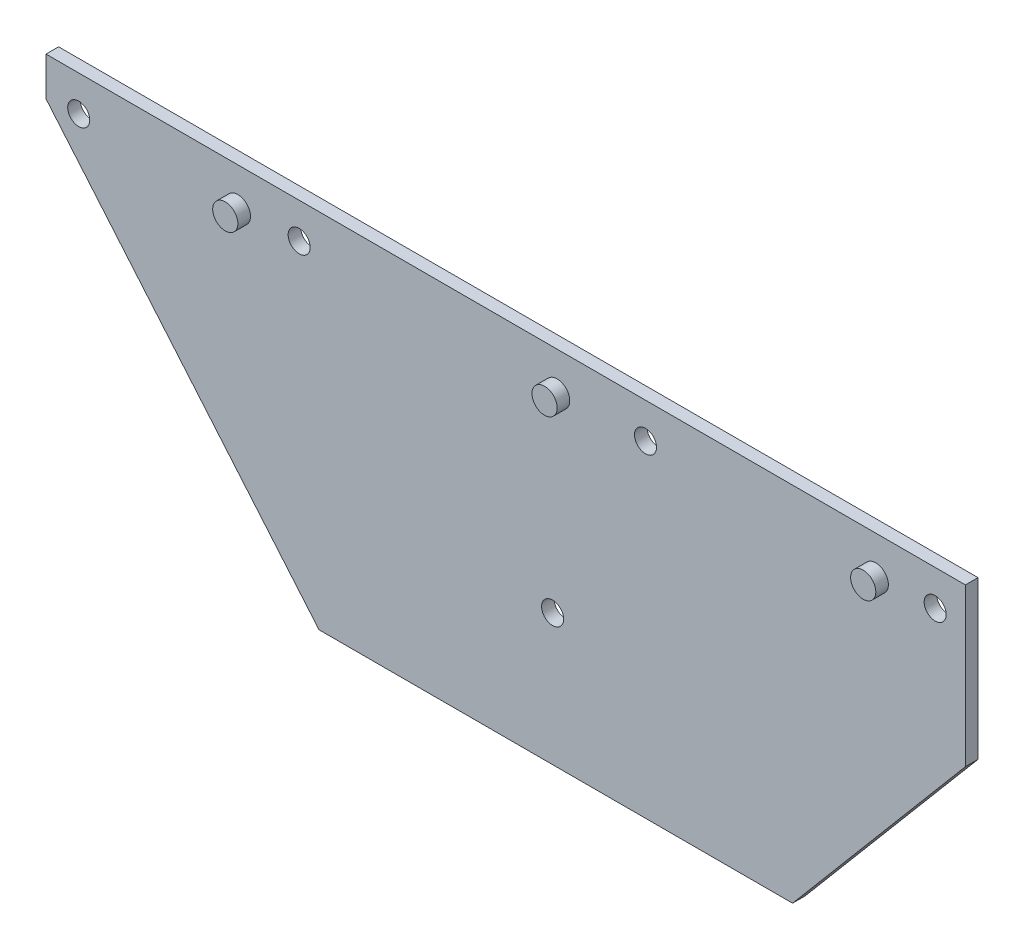
ISO-10303-21;
HEADER;
FILE_DESCRIPTION(('STEP AP214'),'2;1');
FILE_NAME('part.step','',(''),(''),'','','');
FILE_SCHEMA(('AUTOMOTIVE_DESIGN { 1 0 10303 214 1 1 1 1 }'));
ENDSEC;
DATA;
#1=APPLICATION_CONTEXT('core data for automotive mechanical design processes');
#2=APPLICATION_PROTOCOL_DEFINITION('international standard','automotive_design',2000,#1);
#3=PRODUCT_CONTEXT('',#1,'mechanical');
#4=PRODUCT('Part','Part','',(#3));
#5=PRODUCT_RELATED_PRODUCT_CATEGORY('part','',(#4));
#6=PRODUCT_DEFINITION_FORMATION('','',#4);
#7=PRODUCT_DEFINITION_CONTEXT('part definition',#1,'design');
#8=PRODUCT_DEFINITION('design','',#6,#7);
#9=PRODUCT_DEFINITION_SHAPE('','',#8);
#10=(LENGTH_UNIT() NAMED_UNIT(*) SI_UNIT(.MILLI.,.METRE.));
#11=(NAMED_UNIT(*) PLANE_ANGLE_UNIT() SI_UNIT($,.RADIAN.));
#12=(NAMED_UNIT(*) SI_UNIT($,.STERADIAN.) SOLID_ANGLE_UNIT());
#13=UNCERTAINTY_MEASURE_WITH_UNIT(LENGTH_MEASURE(1.E-05),#10,'distance_accuracy_value','');
#14=(GEOMETRIC_REPRESENTATION_CONTEXT(3) GLOBAL_UNCERTAINTY_ASSIGNED_CONTEXT((#13)) GLOBAL_UNIT_ASSIGNED_CONTEXT((#10,
#11,#12)) REPRESENTATION_CONTEXT('',''));
#15=CARTESIAN_POINT('',(0.,0.,0.));
#16=DIRECTION('',(0.,0.,1.));
#17=DIRECTION('',(1.,0.,0.));
#18=AXIS2_PLACEMENT_3D('',#15,#16,#17);
#19=CARTESIAN_POINT('',(0.,0.,2.));
#20=DIRECTION('',(0.,0.,-1.));
#21=DIRECTION('',(-1.,0.,0.));
#22=AXIS2_PLACEMENT_3D('',#19,#20,#21);
#23=PLANE('',#22);
#24=CARTESIAN_POINT('',(58.7699999999999,22.6620282392228,2.));
#25=DIRECTION('',(0.,0.,-1.));
#26=DIRECTION('',(-1.,0.,0.));
#27=AXIS2_PLACEMENT_3D('',#24,#25,#26);
#28=CIRCLE('',#27,2.);
#29=CARTESIAN_POINT('',(56.7699999999999,22.6620282392228,2.));
#30=VERTEX_POINT('',#29);
#31=EDGE_CURVE('E44',#30,#30,#28,.F.);
#32=ORIENTED_EDGE('',*,*,#31,.F.);
#33=EDGE_LOOP('',(#32));
#34=FACE_BOUND('',#33,.T.);
#35=DIRECTION('',(0.,1.,0.));
#36=VECTOR('',#35,1.);
#37=CARTESIAN_POINT('',(72.9999999999999,3.75,2.));
#38=LINE('',#37,#36);
#39=CARTESIAN_POINT('',(72.9999999999999,3.75,2.));
#40=VERTEX_POINT('',#39);
#41=CARTESIAN_POINT('',(72.9999999999999,28.75,2.));
#42=VERTEX_POINT('',#41);
#43=EDGE_CURVE('E132',#40,#42,#38,.T.);
#44=ORIENTED_EDGE('',*,*,#43,.T.);
#45=DIRECTION('',(-1.,0.,0.));
#46=VECTOR('',#45,1.);
#47=CARTESIAN_POINT('',(-73.0000000000001,28.75,2.));
#48=LINE('',#47,#46);
#49=CARTESIAN_POINT('',(-73.0000000000001,28.75,2.));
#50=VERTEX_POINT('',#49);
#51=EDGE_CURVE('E90',#42,#50,#48,.T.);
#52=ORIENTED_EDGE('',*,*,#51,.T.);
#53=DIRECTION('',(0.,-1.,0.));
#54=VECTOR('',#53,1.);
#55=CARTESIAN_POINT('',(-73.,22.5898311404297,2.));
#56=LINE('',#55,#54);
#57=CARTESIAN_POINT('',(-73.,22.5898311404297,2.));
#58=VERTEX_POINT('',#57);
#59=EDGE_CURVE('E103',#50,#58,#56,.T.);
#60=ORIENTED_EDGE('',*,*,#59,.T.);
#61=DIRECTION('',(0.645191033295566,-0.764021289333615,0.));
#62=VECTOR('',#61,1.);
#63=CARTESIAN_POINT('',(-73.,22.5898311404297,2.));
#64=LINE('',#63,#62);
#65=CARTESIAN_POINT('',(-29.645188864299,-28.75,2.));
#66=VERTEX_POINT('',#65);
#67=EDGE_CURVE('E97',#58,#66,#64,.T.);
#68=ORIENTED_EDGE('',*,*,#67,.T.);
#69=DIRECTION('',(1.,0.,0.));
#70=VECTOR('',#69,1.);
#71=CARTESIAN_POINT('',(-29.645188864299,-28.75,2.));
#72=LINE('',#71,#70);
#73=CARTESIAN_POINT('',(45.5548111357011,-28.75,2.));
#74=VERTEX_POINT('',#73);
#75=EDGE_CURVE('E101',#66,#74,#72,.T.);
#76=ORIENTED_EDGE('',*,*,#75,.T.);
#77=DIRECTION('',(0.645191033295572,0.76402128933361,0.));
#78=VECTOR('',#77,1.);
#79=CARTESIAN_POINT('',(72.9999999999999,3.75,2.));
#80=LINE('',#79,#78);
#81=EDGE_CURVE('E52',#74,#40,#80,.T.);
#82=ORIENTED_EDGE('',*,*,#81,.T.);
#83=EDGE_LOOP('',(#44,#52,#60,#68,#76,#82));
#84=FACE_BOUND('',#83,.T.);
#85=CARTESIAN_POINT('',(22.1999999999999,23.13,2.));
#86=DIRECTION('',(0.,0.,1.));
#87=DIRECTION('',(1.,0.,0.));
#88=AXIS2_PLACEMENT_3D('',#85,#86,#87);
#89=CIRCLE('',#88,1.75);
#90=CARTESIAN_POINT('',(23.9499999999999,23.13,2.));
#91=VERTEX_POINT('',#90);
#92=EDGE_CURVE('E125',#91,#91,#89,.T.);
#93=ORIENTED_EDGE('',*,*,#92,.F.);
#94=EDGE_LOOP('',(#93));
#95=FACE_BOUND('',#94,.T.);
#96=CARTESIAN_POINT('',(68.1999999999999,23.13,2.));
#97=DIRECTION('',(0.,0.,1.));
#98=DIRECTION('',(1.,0.,0.));
#99=AXIS2_PLACEMENT_3D('',#96,#97,#98);
#100=CIRCLE('',#99,1.75);
#101=CARTESIAN_POINT('',(69.9499999999999,23.13,2.));
#102=VERTEX_POINT('',#101);
#103=EDGE_CURVE('E187',#102,#102,#100,.T.);
#104=ORIENTED_EDGE('',*,*,#103,.F.);
#105=EDGE_LOOP('',(#104));
#106=FACE_BOUND('',#105,.T.);
#107=CARTESIAN_POINT('',(-32.8000000000001,23.13,2.));
#108=DIRECTION('',(0.,0.,1.));
#109=DIRECTION('',(1.,0.,0.));
#110=AXIS2_PLACEMENT_3D('',#107,#108,#109);
#111=CIRCLE('',#110,1.75);
#112=CARTESIAN_POINT('',(-31.0500000000001,23.13,2.));
#113=VERTEX_POINT('',#112);
#114=EDGE_CURVE('E193',#113,#113,#111,.T.);
#115=ORIENTED_EDGE('',*,*,#114,.F.);
#116=EDGE_LOOP('',(#115));
#117=FACE_BOUND('',#116,.T.);
#118=CARTESIAN_POINT('',(-67.8000000000001,23.13,2.));
#119=DIRECTION('',(0.,0.,1.));
#120=DIRECTION('',(1.,0.,0.));
#121=AXIS2_PLACEMENT_3D('',#118,#119,#120);
#122=CIRCLE('',#121,1.75);
#123=CARTESIAN_POINT('',(-66.0500000000001,23.13,2.));
#124=VERTEX_POINT('',#123);
#125=EDGE_CURVE('E199',#124,#124,#122,.T.);
#126=ORIENTED_EDGE('',*,*,#125,.F.);
#127=EDGE_LOOP('',(#126));
#128=FACE_BOUND('',#127,.T.);
#129=CARTESIAN_POINT('',(7.44999999999993,-7.86999999999999,2.));
#130=DIRECTION('',(0.,0.,1.));
#131=DIRECTION('',(1.,0.,0.));
#132=AXIS2_PLACEMENT_3D('',#129,#130,#131);
#133=CIRCLE('',#132,1.75);
#134=CARTESIAN_POINT('',(9.19999999999994,-7.86999999999999,2.));
#135=VERTEX_POINT('',#134);
#136=EDGE_CURVE('E205',#135,#135,#133,.T.);
#137=ORIENTED_EDGE('',*,*,#136,.F.);
#138=EDGE_LOOP('',(#137));
#139=FACE_BOUND('',#138,.T.);
#140=CARTESIAN_POINT('',(8.16999999999995,22.6620282392228,2.));
#141=DIRECTION('',(0.,0.,-1.));
#142=DIRECTION('',(-1.,0.,0.));
#143=AXIS2_PLACEMENT_3D('',#140,#141,#142);
#144=CIRCLE('',#143,2.);
#145=CARTESIAN_POINT('',(6.16999999999995,22.6620282392228,2.));
#146=VERTEX_POINT('',#145);
#147=EDGE_CURVE('E141',#146,#146,#144,.F.);
#148=ORIENTED_EDGE('',*,*,#147,.F.);
#149=EDGE_LOOP('',(#148));
#150=FACE_BOUND('',#149,.T.);
#151=CARTESIAN_POINT('',(-42.5300000000001,22.6620282392228,2.));
#152=DIRECTION('',(0.,0.,-1.));
#153=DIRECTION('',(-1.,0.,0.));
#154=AXIS2_PLACEMENT_3D('',#151,#152,#153);
#155=CIRCLE('',#154,2.);
#156=CARTESIAN_POINT('',(-44.5300000000001,22.6620282392228,2.));
#157=VERTEX_POINT('',#156);
#158=EDGE_CURVE('E11',#157,#157,#155,.F.);
#159=ORIENTED_EDGE('',*,*,#158,.F.);
#160=EDGE_LOOP('',(#159));
#161=FACE_BOUND('',#160,.T.);
#162=ADVANCED_FACE('F35',(#34,#84,#95,#106,#117,#128,#139,#150,#161),#23,.F.);
#163=CARTESIAN_POINT('',(72.9999999999999,3.75,2.));
#164=DIRECTION('',(-1.,0.,0.));
#165=DIRECTION('',(0.,0.,1.));
#166=AXIS2_PLACEMENT_3D('',#163,#164,#165);
#167=PLANE('',#166);
#168=DIRECTION('',(0.,1.,0.));
#169=VECTOR('',#168,1.);
#170=CARTESIAN_POINT('',(72.9999999999999,3.75,0.));
#171=LINE('',#170,#169);
#172=CARTESIAN_POINT('',(72.9999999999999,3.75,0.));
#173=VERTEX_POINT('',#172);
#174=CARTESIAN_POINT('',(72.9999999999999,28.75,0.));
#175=VERTEX_POINT('',#174);
#176=EDGE_CURVE('E121',#173,#175,#171,.T.);
#177=ORIENTED_EDGE('',*,*,#176,.T.);
#178=DIRECTION('',(0.,0.,-1.));
#179=VECTOR('',#178,1.);
#180=CARTESIAN_POINT('',(72.9999999999999,28.75,2.));
#181=LINE('',#180,#179);
#182=EDGE_CURVE('E139',#42,#175,#181,.T.);
#183=ORIENTED_EDGE('',*,*,#182,.F.);
#184=ORIENTED_EDGE('',*,*,#43,.F.);
#185=DIRECTION('',(0.,0.,-1.));
#186=VECTOR('',#185,1.);
#187=CARTESIAN_POINT('',(72.9999999999999,3.75,2.));
#188=LINE('',#187,#186);
#189=EDGE_CURVE('E117',#40,#173,#188,.T.);
#190=ORIENTED_EDGE('',*,*,#189,.T.);
#191=EDGE_LOOP('',(#177,#183,#184,#190));
#192=FACE_BOUND('',#191,.T.);
#193=ADVANCED_FACE('F37',(#192),#167,.F.);
#194=CARTESIAN_POINT('',(-73.0000000000001,28.75,2.));
#195=DIRECTION('',(0.,-1.,0.));
#196=DIRECTION('',(0.,0.,-1.));
#197=AXIS2_PLACEMENT_3D('',#194,#195,#196);
#198=PLANE('',#197);
#199=DIRECTION('',(-1.,0.,0.));
#200=VECTOR('',#199,1.);
#201=CARTESIAN_POINT('',(-73.0000000000001,28.75,0.));
#202=LINE('',#201,#200);
#203=CARTESIAN_POINT('',(-73.0000000000001,28.75,0.));
#204=VERTEX_POINT('',#203);
#205=EDGE_CURVE('E124',#175,#204,#202,.T.);
#206=ORIENTED_EDGE('',*,*,#205,.T.);
#207=DIRECTION('',(0.,0.,-1.));
#208=VECTOR('',#207,1.);
#209=CARTESIAN_POINT('',(-73.0000000000001,28.75,2.));
#210=LINE('',#209,#208);
#211=EDGE_CURVE('E136',#50,#204,#210,.T.);
#212=ORIENTED_EDGE('',*,*,#211,.F.);
#213=ORIENTED_EDGE('',*,*,#51,.F.);
#214=ORIENTED_EDGE('',*,*,#182,.T.);
#215=EDGE_LOOP('',(#206,#212,#213,#214));
#216=FACE_BOUND('',#215,.T.);
#217=ADVANCED_FACE('F153',(#216),#198,.F.);
#218=CARTESIAN_POINT('',(-73.,22.5898311404297,2.));
#219=DIRECTION('',(1.,0.,0.));
#220=DIRECTION('',(0.,1.,0.));
#221=AXIS2_PLACEMENT_3D('',#218,#219,#220);
#222=PLANE('',#221);
#223=DIRECTION('',(0.,-1.,0.));
#224=VECTOR('',#223,1.);
#225=CARTESIAN_POINT('',(-73.,22.5898311404297,0.));
#226=LINE('',#225,#224);
#227=CARTESIAN_POINT('',(-73.,22.5898311404297,0.));
#228=VERTEX_POINT('',#227);
#229=EDGE_CURVE('E127',#204,#228,#226,.T.);
#230=ORIENTED_EDGE('',*,*,#229,.T.);
#231=DIRECTION('',(0.,0.,-1.));
#232=VECTOR('',#231,1.);
#233=CARTESIAN_POINT('',(-73.,22.5898311404297,2.));
#234=LINE('',#233,#232);
#235=EDGE_CURVE('E112',#58,#228,#234,.T.);
#236=ORIENTED_EDGE('',*,*,#235,.F.);
#237=ORIENTED_EDGE('',*,*,#59,.F.);
#238=ORIENTED_EDGE('',*,*,#211,.T.);
#239=EDGE_LOOP('',(#230,#236,#237,#238));
#240=FACE_BOUND('',#239,.T.);
#241=ADVANCED_FACE('F170',(#240),#222,.F.);
#242=CARTESIAN_POINT('',(-73.,22.5898311404297,2.));
#243=DIRECTION('',(0.764021289333615,0.645191033295566,0.));
#244=DIRECTION('',(-0.645191033295566,0.764021289333615,0.));
#245=AXIS2_PLACEMENT_3D('',#242,#243,#244);
#246=PLANE('',#245);
#247=DIRECTION('',(0.645191033295566,-0.764021289333615,0.));
#248=VECTOR('',#247,1.);
#249=CARTESIAN_POINT('',(-73.,22.5898311404297,0.));
#250=LINE('',#249,#248);
#251=CARTESIAN_POINT('',(-29.645188864299,-28.75,0.));
#252=VERTEX_POINT('',#251);
#253=EDGE_CURVE('E111',#228,#252,#250,.T.);
#254=ORIENTED_EDGE('',*,*,#253,.T.);
#255=DIRECTION('',(0.,0.,-1.));
#256=VECTOR('',#255,1.);
#257=CARTESIAN_POINT('',(-29.645188864299,-28.75,2.));
#258=LINE('',#257,#256);
#259=EDGE_CURVE('E108',#66,#252,#258,.T.);
#260=ORIENTED_EDGE('',*,*,#259,.F.);
#261=ORIENTED_EDGE('',*,*,#67,.F.);
#262=ORIENTED_EDGE('',*,*,#235,.T.);
#263=EDGE_LOOP('',(#254,#260,#261,#262));
#264=FACE_BOUND('',#263,.T.);
#265=ADVANCED_FACE('F109',(#264),#246,.F.);
#266=CARTESIAN_POINT('',(-29.645188864299,-28.75,2.));
#267=DIRECTION('',(0.,1.,0.));
#268=DIRECTION('',(-1.,0.,0.));
#269=AXIS2_PLACEMENT_3D('',#266,#267,#268);
#270=PLANE('',#269);
#271=DIRECTION('',(1.,0.,0.));
#272=VECTOR('',#271,1.);
#273=CARTESIAN_POINT('',(-29.645188864299,-28.75,0.));
#274=LINE('',#273,#272);
#275=CARTESIAN_POINT('',(45.5548111357011,-28.75,0.));
#276=VERTEX_POINT('',#275);
#277=EDGE_CURVE('E75',#252,#276,#274,.T.);
#278=ORIENTED_EDGE('',*,*,#277,.T.);
#279=DIRECTION('',(0.,0.,-1.));
#280=VECTOR('',#279,1.);
#281=CARTESIAN_POINT('',(45.5548111357011,-28.75,2.));
#282=LINE('',#281,#280);
#283=EDGE_CURVE('E113',#74,#276,#282,.T.);
#284=ORIENTED_EDGE('',*,*,#283,.F.);
#285=ORIENTED_EDGE('',*,*,#75,.F.);
#286=ORIENTED_EDGE('',*,*,#259,.T.);
#287=EDGE_LOOP('',(#278,#284,#285,#286));
#288=FACE_BOUND('',#287,.T.);
#289=ADVANCED_FACE('F115',(#288),#270,.F.);
#290=CARTESIAN_POINT('',(72.9999999999999,3.75,2.));
#291=DIRECTION('',(-0.76402128933361,0.645191033295572,0.));
#292=DIRECTION('',(-0.645191033295572,-0.764021289333611,0.));
#293=AXIS2_PLACEMENT_3D('',#290,#291,#292);
#294=PLANE('',#293);
#295=DIRECTION('',(0.645191033295572,0.76402128933361,0.));
#296=VECTOR('',#295,1.);
#297=CARTESIAN_POINT('',(72.9999999999999,3.75,0.));
#298=LINE('',#297,#296);
#299=EDGE_CURVE('E81',#276,#173,#298,.T.);
#300=ORIENTED_EDGE('',*,*,#299,.T.);
#301=ORIENTED_EDGE('',*,*,#189,.F.);
#302=ORIENTED_EDGE('',*,*,#81,.F.);
#303=ORIENTED_EDGE('',*,*,#283,.T.);
#304=EDGE_LOOP('',(#300,#301,#302,#303));
#305=FACE_BOUND('',#304,.T.);
#306=ADVANCED_FACE('F162',(#305),#294,.F.);
#307=CARTESIAN_POINT('',(0.,0.,0.));
#308=DIRECTION('',(0.,0.,-1.));
#309=DIRECTION('',(-1.,0.,0.));
#310=AXIS2_PLACEMENT_3D('',#307,#308,#309);
#311=PLANE('',#310);
#312=CARTESIAN_POINT('',(7.44999999999993,-7.86999999999999,0.));
#313=DIRECTION('',(0.,0.,-1.));
#314=DIRECTION('',(-1.,0.,0.));
#315=AXIS2_PLACEMENT_3D('',#312,#313,#314);
#316=CIRCLE('',#315,1.75);
#317=CARTESIAN_POINT('',(5.69999999999993,-7.86999999999999,0.));
#318=VERTEX_POINT('',#317);
#319=EDGE_CURVE('E208',#318,#318,#316,.F.);
#320=ORIENTED_EDGE('',*,*,#319,.T.);
#321=EDGE_LOOP('',(#320));
#322=FACE_BOUND('',#321,.T.);
#323=CARTESIAN_POINT('',(-67.8000000000001,23.13,0.));
#324=DIRECTION('',(0.,0.,-1.));
#325=DIRECTION('',(-1.,0.,0.));
#326=AXIS2_PLACEMENT_3D('',#323,#324,#325);
#327=CIRCLE('',#326,1.75);
#328=CARTESIAN_POINT('',(-69.5500000000001,23.13,0.));
#329=VERTEX_POINT('',#328);
#330=EDGE_CURVE('E202',#329,#329,#327,.F.);
#331=ORIENTED_EDGE('',*,*,#330,.T.);
#332=EDGE_LOOP('',(#331));
#333=FACE_BOUND('',#332,.T.);
#334=CARTESIAN_POINT('',(-32.8000000000001,23.13,0.));
#335=DIRECTION('',(0.,0.,-1.));
#336=DIRECTION('',(-1.,0.,0.));
#337=AXIS2_PLACEMENT_3D('',#334,#335,#336);
#338=CIRCLE('',#337,1.75);
#339=CARTESIAN_POINT('',(-34.5500000000001,23.13,0.));
#340=VERTEX_POINT('',#339);
#341=EDGE_CURVE('E196',#340,#340,#338,.F.);
#342=ORIENTED_EDGE('',*,*,#341,.T.);
#343=EDGE_LOOP('',(#342));
#344=FACE_BOUND('',#343,.T.);
#345=CARTESIAN_POINT('',(68.1999999999999,23.13,0.));
#346=DIRECTION('',(0.,0.,-1.));
#347=DIRECTION('',(-1.,0.,0.));
#348=AXIS2_PLACEMENT_3D('',#345,#346,#347);
#349=CIRCLE('',#348,1.75);
#350=CARTESIAN_POINT('',(66.4499999999999,23.13,0.));
#351=VERTEX_POINT('',#350);
#352=EDGE_CURVE('E190',#351,#351,#349,.F.);
#353=ORIENTED_EDGE('',*,*,#352,.T.);
#354=EDGE_LOOP('',(#353));
#355=FACE_BOUND('',#354,.T.);
#356=CARTESIAN_POINT('',(22.1999999999999,23.13,0.));
#357=DIRECTION('',(0.,0.,-1.));
#358=DIRECTION('',(-1.,0.,0.));
#359=AXIS2_PLACEMENT_3D('',#356,#357,#358);
#360=CIRCLE('',#359,1.75);
#361=CARTESIAN_POINT('',(20.4499999999999,23.13,0.));
#362=VERTEX_POINT('',#361);
#363=EDGE_CURVE('E184',#362,#362,#360,.F.);
#364=ORIENTED_EDGE('',*,*,#363,.T.);
#365=EDGE_LOOP('',(#364));
#366=FACE_BOUND('',#365,.T.);
#367=ORIENTED_EDGE('',*,*,#176,.F.);
#368=ORIENTED_EDGE('',*,*,#299,.F.);
#369=ORIENTED_EDGE('',*,*,#277,.F.);
#370=ORIENTED_EDGE('',*,*,#253,.F.);
#371=ORIENTED_EDGE('',*,*,#229,.F.);
#372=ORIENTED_EDGE('',*,*,#205,.F.);
#373=EDGE_LOOP('',(#367,#368,#369,#370,#371,#372));
#374=FACE_BOUND('',#373,.T.);
#375=ADVANCED_FACE('F159',(#322,#333,#344,#355,#366,#374),#311,.T.);
#376=CARTESIAN_POINT('',(22.1999999999999,23.13,-0.00100000000000013));
#377=DIRECTION('',(0.,0.,1.));
#378=DIRECTION('',(1.,0.,0.));
#379=AXIS2_PLACEMENT_3D('',#376,#377,#378);
#380=CYLINDRICAL_SURFACE('',#379,1.75);
#381=ORIENTED_EDGE('',*,*,#363,.F.);
#382=EDGE_LOOP('',(#381));
#383=FACE_BOUND('',#382,.T.);
#384=ORIENTED_EDGE('',*,*,#92,.T.);
#385=EDGE_LOOP('',(#384));
#386=FACE_BOUND('',#385,.T.);
#387=ADVANCED_FACE('F157',(#383,#386),#380,.F.);
#388=CARTESIAN_POINT('',(68.1999999999999,23.13,-0.00100000000000013));
#389=DIRECTION('',(0.,0.,1.));
#390=DIRECTION('',(1.,0.,0.));
#391=AXIS2_PLACEMENT_3D('',#388,#389,#390);
#392=CYLINDRICAL_SURFACE('',#391,1.75);
#393=ORIENTED_EDGE('',*,*,#352,.F.);
#394=EDGE_LOOP('',(#393));
#395=FACE_BOUND('',#394,.T.);
#396=ORIENTED_EDGE('',*,*,#103,.T.);
#397=EDGE_LOOP('',(#396));
#398=FACE_BOUND('',#397,.T.);
#399=ADVANCED_FACE('F261',(#395,#398),#392,.F.);
#400=CARTESIAN_POINT('',(-32.8000000000001,23.13,-0.00100000000000013));
#401=DIRECTION('',(0.,0.,1.));
#402=DIRECTION('',(1.,0.,0.));
#403=AXIS2_PLACEMENT_3D('',#400,#401,#402);
#404=CYLINDRICAL_SURFACE('',#403,1.75);
#405=ORIENTED_EDGE('',*,*,#341,.F.);
#406=EDGE_LOOP('',(#405));
#407=FACE_BOUND('',#406,.T.);
#408=ORIENTED_EDGE('',*,*,#114,.T.);
#409=EDGE_LOOP('',(#408));
#410=FACE_BOUND('',#409,.T.);
#411=ADVANCED_FACE('F258',(#407,#410),#404,.F.);
#412=CARTESIAN_POINT('',(-67.8000000000001,23.13,-0.00100000000000013));
#413=DIRECTION('',(0.,0.,1.));
#414=DIRECTION('',(1.,0.,0.));
#415=AXIS2_PLACEMENT_3D('',#412,#413,#414);
#416=CYLINDRICAL_SURFACE('',#415,1.75);
#417=ORIENTED_EDGE('',*,*,#330,.F.);
#418=EDGE_LOOP('',(#417));
#419=FACE_BOUND('',#418,.T.);
#420=ORIENTED_EDGE('',*,*,#125,.T.);
#421=EDGE_LOOP('',(#420));
#422=FACE_BOUND('',#421,.T.);
#423=ADVANCED_FACE('F254',(#419,#422),#416,.F.);
#424=CARTESIAN_POINT('',(7.44999999999993,-7.86999999999999,-0.00100000000000013));
#425=DIRECTION('',(0.,0.,1.));
#426=DIRECTION('',(1.,0.,0.));
#427=AXIS2_PLACEMENT_3D('',#424,#425,#426);
#428=CYLINDRICAL_SURFACE('',#427,1.75);
#429=ORIENTED_EDGE('',*,*,#319,.F.);
#430=EDGE_LOOP('',(#429));
#431=FACE_BOUND('',#430,.T.);
#432=ORIENTED_EDGE('',*,*,#136,.T.);
#433=EDGE_LOOP('',(#432));
#434=FACE_BOUND('',#433,.T.);
#435=ADVANCED_FACE('F250',(#431,#434),#428,.F.);
#436=CARTESIAN_POINT('',(8.16999999999995,22.6620282392228,4.));
#437=DIRECTION('',(0.,0.,-1.));
#438=DIRECTION('',(-1.,0.,0.));
#439=AXIS2_PLACEMENT_3D('',#436,#437,#438);
#440=CYLINDRICAL_SURFACE('',#439,2.);
#441=CARTESIAN_POINT('',(8.16999999999995,22.6620282392228,4.));
#442=DIRECTION('',(0.,0.,1.));
#443=DIRECTION('',(1.,0.,0.));
#444=AXIS2_PLACEMENT_3D('',#441,#442,#443);
#445=CIRCLE('',#444,2.);
#446=CARTESIAN_POINT('',(10.17,22.6620282392228,4.));
#447=VERTEX_POINT('',#446);
#448=EDGE_CURVE('E211',#447,#447,#445,.T.);
#449=ORIENTED_EDGE('',*,*,#448,.F.);
#450=EDGE_LOOP('',(#449));
#451=FACE_BOUND('',#450,.T.);
#452=ORIENTED_EDGE('',*,*,#147,.T.);
#453=EDGE_LOOP('',(#452));
#454=FACE_BOUND('',#453,.T.);
#455=ADVANCED_FACE('F246',(#451,#454),#440,.T.);
#456=CARTESIAN_POINT('',(8.16999999999995,22.6620282392228,4.));
#457=DIRECTION('',(0.,0.,1.));
#458=DIRECTION('',(1.,0.,0.));
#459=AXIS2_PLACEMENT_3D('',#456,#457,#458);
#460=PLANE('',#459);
#461=ORIENTED_EDGE('',*,*,#448,.T.);
#462=EDGE_LOOP('',(#461));
#463=FACE_BOUND('',#462,.T.);
#464=ADVANCED_FACE('F242',(#463),#460,.T.);
#465=CARTESIAN_POINT('',(58.7699999999999,22.6620282392228,4.));
#466=DIRECTION('',(0.,0.,-1.));
#467=DIRECTION('',(-1.,0.,0.));
#468=AXIS2_PLACEMENT_3D('',#465,#466,#467);
#469=CYLINDRICAL_SURFACE('',#468,2.);
#470=CARTESIAN_POINT('',(58.7699999999999,22.6620282392228,4.));
#471=DIRECTION('',(0.,0.,1.));
#472=DIRECTION('',(1.,0.,0.));
#473=AXIS2_PLACEMENT_3D('',#470,#471,#472);
#474=CIRCLE('',#473,2.);
#475=CARTESIAN_POINT('',(60.7699999999999,22.6620282392228,4.));
#476=VERTEX_POINT('',#475);
#477=EDGE_CURVE('E216',#476,#476,#474,.T.);
#478=ORIENTED_EDGE('',*,*,#477,.F.);
#479=EDGE_LOOP('',(#478));
#480=FACE_BOUND('',#479,.T.);
#481=ORIENTED_EDGE('',*,*,#31,.T.);
#482=EDGE_LOOP('',(#481));
#483=FACE_BOUND('',#482,.T.);
#484=ADVANCED_FACE('F146',(#480,#483),#469,.T.);
#485=CARTESIAN_POINT('',(58.7699999999999,22.6620282392228,4.));
#486=DIRECTION('',(0.,0.,1.));
#487=DIRECTION('',(1.,0.,0.));
#488=AXIS2_PLACEMENT_3D('',#485,#486,#487);
#489=PLANE('',#488);
#490=ORIENTED_EDGE('',*,*,#477,.T.);
#491=EDGE_LOOP('',(#490));
#492=FACE_BOUND('',#491,.T.);
#493=ADVANCED_FACE('F228',(#492),#489,.T.);
#494=CARTESIAN_POINT('',(-42.5300000000001,22.6620282392228,4.));
#495=DIRECTION('',(0.,0.,-1.));
#496=DIRECTION('',(-1.,0.,0.));
#497=AXIS2_PLACEMENT_3D('',#494,#495,#496);
#498=CYLINDRICAL_SURFACE('',#497,2.);
#499=CARTESIAN_POINT('',(-42.5300000000001,22.6620282392228,4.));
#500=DIRECTION('',(0.,0.,1.));
#501=DIRECTION('',(1.,0.,0.));
#502=AXIS2_PLACEMENT_3D('',#499,#500,#501);
#503=CIRCLE('',#502,2.);
#504=CARTESIAN_POINT('',(-40.5300000000001,22.6620282392228,4.));
#505=VERTEX_POINT('',#504);
#506=EDGE_CURVE('E219',#505,#505,#503,.T.);
#507=ORIENTED_EDGE('',*,*,#506,.F.);
#508=EDGE_LOOP('',(#507));
#509=FACE_BOUND('',#508,.T.);
#510=ORIENTED_EDGE('',*,*,#158,.T.);
#511=EDGE_LOOP('',(#510));
#512=FACE_BOUND('',#511,.T.);
#513=ADVANCED_FACE('F225',(#509,#512),#498,.T.);
#514=CARTESIAN_POINT('',(-42.5300000000001,22.6620282392228,4.));
#515=DIRECTION('',(0.,0.,1.));
#516=DIRECTION('',(1.,0.,0.));
#517=AXIS2_PLACEMENT_3D('',#514,#515,#516);
#518=PLANE('',#517);
#519=ORIENTED_EDGE('',*,*,#506,.T.);
#520=EDGE_LOOP('',(#519));
#521=FACE_BOUND('',#520,.T.);
#522=ADVANCED_FACE('F223',(#521),#518,.T.);
#523=CLOSED_SHELL('',(#162,#193,#217,#241,#265,#289,#306,#375,#387,#399,#411,#423,#435,#455,
#464,#484,#493,#513,#522));
#524=MANIFOLD_SOLID_BREP('B2',#523);
#525=ADVANCED_BREP_SHAPE_REPRESENTATION('',(#18,#524),#14);
#526=SHAPE_DEFINITION_REPRESENTATION(#9,#525);
ENDSEC;
END-ISO-10303-21;
